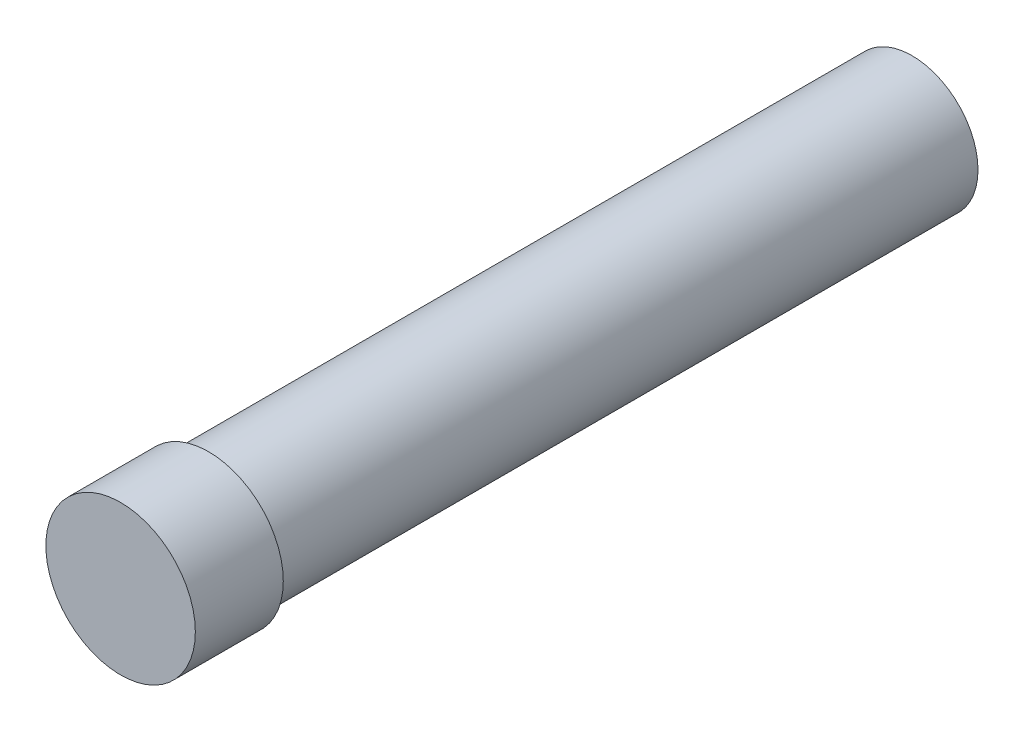
ISO-10303-21;
HEADER;
FILE_DESCRIPTION(('STEP AP214'),'2;1');
FILE_NAME('part.step','',(''),(''),'','','');
FILE_SCHEMA(('AUTOMOTIVE_DESIGN { 1 0 10303 214 1 1 1 1 }'));
ENDSEC;
DATA;
#1=APPLICATION_CONTEXT('core data for automotive mechanical design processes');
#2=APPLICATION_PROTOCOL_DEFINITION('international standard','automotive_design',2000,#1);
#3=PRODUCT_CONTEXT('',#1,'mechanical');
#4=PRODUCT('Part','Part','',(#3));
#5=PRODUCT_RELATED_PRODUCT_CATEGORY('part','',(#4));
#6=PRODUCT_DEFINITION_FORMATION('','',#4);
#7=PRODUCT_DEFINITION_CONTEXT('part definition',#1,'design');
#8=PRODUCT_DEFINITION('design','',#6,#7);
#9=PRODUCT_DEFINITION_SHAPE('','',#8);
#10=(LENGTH_UNIT() NAMED_UNIT(*) SI_UNIT(.MILLI.,.METRE.));
#11=(NAMED_UNIT(*) PLANE_ANGLE_UNIT() SI_UNIT($,.RADIAN.));
#12=(NAMED_UNIT(*) SI_UNIT($,.STERADIAN.) SOLID_ANGLE_UNIT());
#13=UNCERTAINTY_MEASURE_WITH_UNIT(LENGTH_MEASURE(1.E-05),#10,'distance_accuracy_value','');
#14=(GEOMETRIC_REPRESENTATION_CONTEXT(3) GLOBAL_UNCERTAINTY_ASSIGNED_CONTEXT((#13)) GLOBAL_UNIT_ASSIGNED_CONTEXT((#10,
#11,#12)) REPRESENTATION_CONTEXT('',''));
#15=CARTESIAN_POINT('',(0.,0.,0.));
#16=DIRECTION('',(0.,0.,1.));
#17=DIRECTION('',(1.,0.,0.));
#18=AXIS2_PLACEMENT_3D('',#15,#16,#17);
#19=CARTESIAN_POINT('',(0.,0.,800.));
#20=DIRECTION('',(0.,0.,-1.));
#21=DIRECTION('',(-1.,0.,0.));
#22=AXIS2_PLACEMENT_3D('',#19,#20,#21);
#23=CYLINDRICAL_SURFACE('',#22,75.);
#24=CARTESIAN_POINT('',(0.,0.,800.));
#25=DIRECTION('',(0.,0.,1.));
#26=DIRECTION('',(1.,0.,0.));
#27=AXIS2_PLACEMENT_3D('',#24,#25,#26);
#28=CIRCLE('',#27,75.);
#29=CARTESIAN_POINT('',(75.,0.,800.));
#30=VERTEX_POINT('',#29);
#31=EDGE_CURVE('E10',#30,#30,#28,.T.);
#32=ORIENTED_EDGE('',*,*,#31,.F.);
#33=EDGE_LOOP('',(#32));
#34=FACE_BOUND('',#33,.T.);
#35=CARTESIAN_POINT('',(0.,0.,0.));
#36=DIRECTION('',(0.,0.,1.));
#37=DIRECTION('',(1.,0.,0.));
#38=AXIS2_PLACEMENT_3D('',#35,#36,#37);
#39=CIRCLE('',#38,75.);
#40=CARTESIAN_POINT('',(75.,0.,0.));
#41=VERTEX_POINT('',#40);
#42=EDGE_CURVE('E34',#41,#41,#39,.T.);
#43=ORIENTED_EDGE('',*,*,#42,.T.);
#44=EDGE_LOOP('',(#43));
#45=FACE_BOUND('',#44,.T.);
#46=ADVANCED_FACE('F31',(#34,#45),#23,.T.);
#47=CARTESIAN_POINT('',(0.,0.,0.));
#48=DIRECTION('',(0.,0.,1.));
#49=DIRECTION('',(1.,0.,0.));
#50=AXIS2_PLACEMENT_3D('',#47,#48,#49);
#51=PLANE('',#50);
#52=ORIENTED_EDGE('',*,*,#42,.F.);
#53=EDGE_LOOP('',(#52));
#54=FACE_BOUND('',#53,.T.);
#55=ADVANCED_FACE('F54',(#54),#51,.F.);
#56=CARTESIAN_POINT('',(0.,0.,900.));
#57=DIRECTION('',(0.,0.,-1.));
#58=DIRECTION('',(-1.,0.,0.));
#59=AXIS2_PLACEMENT_3D('',#56,#57,#58);
#60=CYLINDRICAL_SURFACE('',#59,85.);
#61=CARTESIAN_POINT('',(0.,0.,900.));
#62=DIRECTION('',(0.,0.,1.));
#63=DIRECTION('',(1.,0.,0.));
#64=AXIS2_PLACEMENT_3D('',#61,#62,#63);
#65=CIRCLE('',#64,85.);
#66=CARTESIAN_POINT('',(85.,0.,900.));
#67=VERTEX_POINT('',#66);
#68=EDGE_CURVE('E41',#67,#67,#65,.T.);
#69=ORIENTED_EDGE('',*,*,#68,.F.);
#70=EDGE_LOOP('',(#69));
#71=FACE_BOUND('',#70,.T.);
#72=CARTESIAN_POINT('',(0.,0.,800.));
#73=DIRECTION('',(0.,0.,1.));
#74=DIRECTION('',(1.,0.,0.));
#75=AXIS2_PLACEMENT_3D('',#72,#73,#74);
#76=CIRCLE('',#75,85.);
#77=CARTESIAN_POINT('',(85.,0.,800.));
#78=VERTEX_POINT('',#77);
#79=EDGE_CURVE('E43',#78,#78,#76,.T.);
#80=ORIENTED_EDGE('',*,*,#79,.T.);
#81=EDGE_LOOP('',(#80));
#82=FACE_BOUND('',#81,.T.);
#83=ADVANCED_FACE('F51',(#71,#82),#60,.T.);
#84=CARTESIAN_POINT('',(0.,0.,900.));
#85=DIRECTION('',(0.,0.,1.));
#86=DIRECTION('',(1.,0.,0.));
#87=AXIS2_PLACEMENT_3D('',#84,#85,#86);
#88=PLANE('',#87);
#89=ORIENTED_EDGE('',*,*,#68,.T.);
#90=EDGE_LOOP('',(#89));
#91=FACE_BOUND('',#90,.T.);
#92=ADVANCED_FACE('F49',(#91),#88,.T.);
#93=CARTESIAN_POINT('',(0.,0.,800.));
#94=DIRECTION('',(0.,0.,1.));
#95=DIRECTION('',(1.,0.,0.));
#96=AXIS2_PLACEMENT_3D('',#93,#94,#95);
#97=PLANE('',#96);
#98=ORIENTED_EDGE('',*,*,#31,.T.);
#99=EDGE_LOOP('',(#98));
#100=FACE_BOUND('',#99,.T.);
#101=ORIENTED_EDGE('',*,*,#79,.F.);
#102=EDGE_LOOP('',(#101));
#103=FACE_BOUND('',#102,.T.);
#104=ADVANCED_FACE('F58',(#100,#103),#97,.F.);
#105=CLOSED_SHELL('',(#46,#55,#83,#92,#104));
#106=MANIFOLD_SOLID_BREP('B2',#105);
#107=ADVANCED_BREP_SHAPE_REPRESENTATION('',(#18,#106),#14);
#108=SHAPE_DEFINITION_REPRESENTATION(#9,#107);
ENDSEC;
END-ISO-10303-21;
